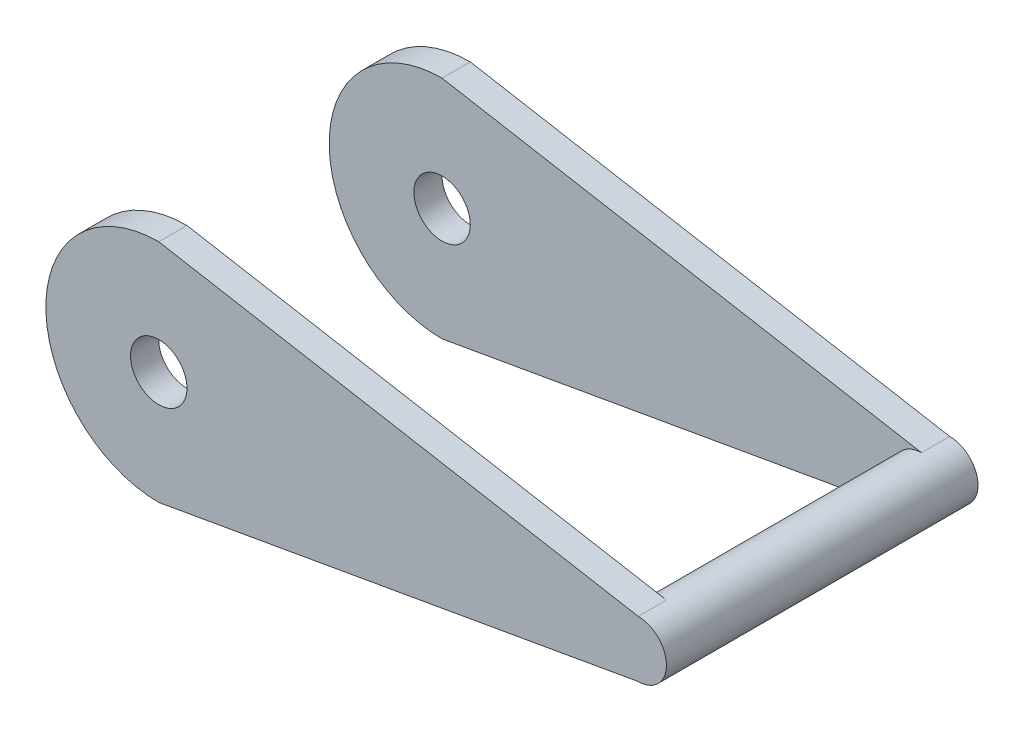
ISO-10303-21;
HEADER;
FILE_DESCRIPTION(('STEP AP214'),'2;1');
FILE_NAME('part.step','',(''),(''),'','','');
FILE_SCHEMA(('AUTOMOTIVE_DESIGN { 1 0 10303 214 1 1 1 1 }'));
ENDSEC;
DATA;
#1=APPLICATION_CONTEXT('core data for automotive mechanical design processes');
#2=APPLICATION_PROTOCOL_DEFINITION('international standard','automotive_design',2000,#1);
#3=PRODUCT_CONTEXT('',#1,'mechanical');
#4=PRODUCT('Part','Part','',(#3));
#5=PRODUCT_RELATED_PRODUCT_CATEGORY('part','',(#4));
#6=PRODUCT_DEFINITION_FORMATION('','',#4);
#7=PRODUCT_DEFINITION_CONTEXT('part definition',#1,'design');
#8=PRODUCT_DEFINITION('design','',#6,#7);
#9=PRODUCT_DEFINITION_SHAPE('','',#8);
#10=(LENGTH_UNIT() NAMED_UNIT(*) SI_UNIT(.MILLI.,.METRE.));
#11=(NAMED_UNIT(*) PLANE_ANGLE_UNIT() SI_UNIT($,.RADIAN.));
#12=(NAMED_UNIT(*) SI_UNIT($,.STERADIAN.) SOLID_ANGLE_UNIT());
#13=UNCERTAINTY_MEASURE_WITH_UNIT(LENGTH_MEASURE(1.E-05),#10,'distance_accuracy_value','');
#14=(GEOMETRIC_REPRESENTATION_CONTEXT(3) GLOBAL_UNCERTAINTY_ASSIGNED_CONTEXT((#13)) GLOBAL_UNIT_ASSIGNED_CONTEXT((#10,
#11,#12)) REPRESENTATION_CONTEXT('',''));
#15=CARTESIAN_POINT('',(0.,0.,0.));
#16=DIRECTION('',(0.,0.,1.));
#17=DIRECTION('',(1.,0.,0.));
#18=AXIS2_PLACEMENT_3D('',#15,#16,#17);
#19=CARTESIAN_POINT('',(20.3381760228693,115.189344312511,14.351));
#20=DIRECTION('',(-0.173873587443369,-0.984767980587089,0.));
#21=DIRECTION('',(0.984767980587089,-0.173873587443369,0.));
#22=AXIS2_PLACEMENT_3D('',#19,#20,#21);
#23=PLANE('',#22);
#24=DIRECTION('',(0.984767980587089,-0.173873587443369,0.));
#25=VECTOR('',#24,1.);
#26=CARTESIAN_POINT('',(20.3381760228693,115.189344312511,17.526));
#27=LINE('',#26,#25);
#28=CARTESIAN_POINT('',(238.125,76.7362496452517,17.526));
#29=VERTEX_POINT('',#28);
#30=CARTESIAN_POINT('',(292.071750354749,67.2112496452516,17.526));
#31=VERTEX_POINT('',#30);
#32=EDGE_CURVE('E175',#29,#31,#27,.T.);
#33=ORIENTED_EDGE('',*,*,#32,.T.);
#34=DIRECTION('',(0.,0.,1.));
#35=VECTOR('',#34,1.);
#36=CARTESIAN_POINT('',(292.071750354749,67.2112496452516,14.351));
#37=LINE('',#36,#35);
#38=CARTESIAN_POINT('',(292.071750354749,67.2112496452516,14.351));
#39=VERTEX_POINT('',#38);
#40=EDGE_CURVE('E48',#39,#31,#37,.T.);
#41=ORIENTED_EDGE('',*,*,#40,.F.);
#42=DIRECTION('',(0.984767980587089,-0.173873587443369,0.));
#43=VECTOR('',#42,1.);
#44=CARTESIAN_POINT('',(20.3381760228693,115.189344312511,14.351));
#45=LINE('',#44,#43);
#46=CARTESIAN_POINT('',(238.125,76.7362496452517,14.351));
#47=VERTEX_POINT('',#46);
#48=EDGE_CURVE('E166',#47,#39,#45,.T.);
#49=ORIENTED_EDGE('',*,*,#48,.F.);
#50=DIRECTION('',(0.,0.,1.));
#51=VECTOR('',#50,1.);
#52=CARTESIAN_POINT('',(238.125,76.7362496452517,14.351));
#53=LINE('',#52,#51);
#54=EDGE_CURVE('E42',#47,#29,#53,.T.);
#55=ORIENTED_EDGE('',*,*,#54,.T.);
#56=EDGE_LOOP('',(#33,#41,#49,#55));
#57=FACE_BOUND('',#56,.T.);
#58=ADVANCED_FACE('F38',(#57),#23,.F.);
#59=CARTESIAN_POINT('',(292.071750354749,64.0362496452517,14.351));
#60=DIRECTION('',(0.,0.,1.));
#61=DIRECTION('',(1.,0.,0.));
#62=AXIS2_PLACEMENT_3D('',#59,#60,#61);
#63=CYLINDRICAL_SURFACE('',#62,3.17499999999997);
#64=CARTESIAN_POINT('',(292.071750354749,64.0362496452517,17.526));
#65=DIRECTION('',(0.,0.,1.));
#66=DIRECTION('',(1.,0.,0.));
#67=AXIS2_PLACEMENT_3D('',#64,#65,#66);
#68=CIRCLE('',#67,3.17499999999997);
#69=CARTESIAN_POINT('',(292.071750354749,60.8612496452517,17.526));
#70=VERTEX_POINT('',#69);
#71=EDGE_CURVE('E167',#70,#31,#68,.T.);
#72=ORIENTED_EDGE('',*,*,#71,.F.);
#73=DIRECTION('',(0.,0.,1.));
#74=VECTOR('',#73,1.);
#75=CARTESIAN_POINT('',(292.071750354749,60.8612496452517,14.351));
#76=LINE('',#75,#74);
#77=CARTESIAN_POINT('',(292.071750354749,60.8612496452517,14.351));
#78=VERTEX_POINT('',#77);
#79=EDGE_CURVE('E73',#78,#70,#76,.T.);
#80=ORIENTED_EDGE('',*,*,#79,.F.);
#81=CARTESIAN_POINT('',(292.071750354749,64.0362496452517,14.351));
#82=DIRECTION('',(0.,0.,-1.));
#83=DIRECTION('',(-1.,0.,0.));
#84=AXIS2_PLACEMENT_3D('',#81,#82,#83);
#85=CIRCLE('',#84,3.17499999999997);
#86=EDGE_CURVE('E11',#78,#39,#85,.T.);
#87=ORIENTED_EDGE('',*,*,#86,.T.);
#88=ORIENTED_EDGE('',*,*,#40,.T.);
#89=EDGE_LOOP('',(#72,#80,#87,#88));
#90=FACE_BOUND('',#89,.T.);
#91=CARTESIAN_POINT('',(292.071750354749,64.0362496452517,-17.526));
#92=DIRECTION('',(0.,0.,1.));
#93=DIRECTION('',(1.,0.,0.));
#94=AXIS2_PLACEMENT_3D('',#91,#92,#93);
#95=CIRCLE('',#94,3.17499999999997);
#96=CARTESIAN_POINT('',(292.071750354749,60.8612496452517,-17.526));
#97=VERTEX_POINT('',#96);
#98=CARTESIAN_POINT('',(292.071750354749,67.2112496452516,-17.526));
#99=VERTEX_POINT('',#98);
#100=EDGE_CURVE('E131',#97,#99,#95,.T.);
#101=ORIENTED_EDGE('',*,*,#100,.T.);
#102=DIRECTION('',(0.,0.,-1.));
#103=VECTOR('',#102,1.);
#104=CARTESIAN_POINT('',(292.071750354749,67.2112496452516,-14.351));
#105=LINE('',#104,#103);
#106=CARTESIAN_POINT('',(292.071750354749,67.2112496452516,-14.351));
#107=VERTEX_POINT('',#106);
#108=EDGE_CURVE('E126',#107,#99,#105,.T.);
#109=ORIENTED_EDGE('',*,*,#108,.F.);
#110=CARTESIAN_POINT('',(292.071750354749,64.0362496452517,-14.351));
#111=DIRECTION('',(0.,0.,-1.));
#112=DIRECTION('',(-1.,0.,0.));
#113=AXIS2_PLACEMENT_3D('',#110,#111,#112);
#114=CIRCLE('',#113,3.17499999999997);
#115=CARTESIAN_POINT('',(292.071750354749,60.8612496452517,-14.351));
#116=VERTEX_POINT('',#115);
#117=EDGE_CURVE('E113',#116,#107,#114,.T.);
#118=ORIENTED_EDGE('',*,*,#117,.F.);
#119=DIRECTION('',(0.,0.,-1.));
#120=VECTOR('',#119,1.);
#121=CARTESIAN_POINT('',(292.071750354749,60.8612496452517,-14.351));
#122=LINE('',#121,#120);
#123=EDGE_CURVE('E135',#116,#97,#122,.T.);
#124=ORIENTED_EDGE('',*,*,#123,.T.);
#125=EDGE_LOOP('',(#101,#109,#118,#124));
#126=FACE_BOUND('',#125,.T.);
#127=ADVANCED_FACE('F129',(#90,#126),#63,.T.);
#128=CARTESIAN_POINT('',(-1.59105580116888,9.01126405313727,14.351));
#129=DIRECTION('',(0.173873587443369,-0.984767980587089,0.));
#130=DIRECTION('',(0.984767980587089,0.173873587443369,0.));
#131=AXIS2_PLACEMENT_3D('',#128,#129,#130);
#132=PLANE('',#131);
#133=DIRECTION('',(0.984767980587089,0.173873587443369,0.));
#134=VECTOR('',#133,1.);
#135=CARTESIAN_POINT('',(-1.59105580116888,9.01126405313727,17.526));
#136=LINE('',#135,#134);
#137=CARTESIAN_POINT('',(238.125,51.3362496452517,17.526));
#138=VERTEX_POINT('',#137);
#139=EDGE_CURVE('E180',#138,#70,#136,.T.);
#140=ORIENTED_EDGE('',*,*,#139,.F.);
#141=DIRECTION('',(0.,0.,1.));
#142=VECTOR('',#141,1.);
#143=CARTESIAN_POINT('',(238.125,51.3362496452517,14.351));
#144=LINE('',#143,#142);
#145=CARTESIAN_POINT('',(238.125,51.3362496452517,14.351));
#146=VERTEX_POINT('',#145);
#147=EDGE_CURVE('E185',#146,#138,#144,.T.);
#148=ORIENTED_EDGE('',*,*,#147,.F.);
#149=DIRECTION('',(0.984767980587089,0.173873587443369,0.));
#150=VECTOR('',#149,1.);
#151=CARTESIAN_POINT('',(-1.59105580116888,9.01126405313727,14.351));
#152=LINE('',#151,#150);
#153=EDGE_CURVE('E171',#146,#78,#152,.T.);
#154=ORIENTED_EDGE('',*,*,#153,.T.);
#155=ORIENTED_EDGE('',*,*,#79,.T.);
#156=EDGE_LOOP('',(#140,#148,#154,#155));
#157=FACE_BOUND('',#156,.T.);
#158=ADVANCED_FACE('F200',(#157),#132,.T.);
#159=CARTESIAN_POINT('',(238.125,64.0362496452517,14.351));
#160=DIRECTION('',(0.,0.,1.));
#161=DIRECTION('',(1.,0.,0.));
#162=AXIS2_PLACEMENT_3D('',#159,#160,#161);
#163=CYLINDRICAL_SURFACE('',#162,3.175);
#164=CARTESIAN_POINT('',(238.125,64.0362496452517,14.351));
#165=DIRECTION('',(0.,0.,1.));
#166=DIRECTION('',(1.,0.,0.));
#167=AXIS2_PLACEMENT_3D('',#164,#165,#166);
#168=CIRCLE('',#167,3.175);
#169=CARTESIAN_POINT('',(241.3,64.0362496452517,14.351));
#170=VERTEX_POINT('',#169);
#171=EDGE_CURVE('E163',#170,#170,#168,.T.);
#172=ORIENTED_EDGE('',*,*,#171,.F.);
#173=EDGE_LOOP('',(#172));
#174=FACE_BOUND('',#173,.T.);
#175=CARTESIAN_POINT('',(238.125,64.0362496452517,17.526));
#176=DIRECTION('',(0.,0.,1.));
#177=DIRECTION('',(1.,0.,0.));
#178=AXIS2_PLACEMENT_3D('',#175,#176,#177);
#179=CIRCLE('',#178,3.175);
#180=CARTESIAN_POINT('',(241.3,64.0362496452517,17.526));
#181=VERTEX_POINT('',#180);
#182=EDGE_CURVE('E125',#181,#181,#179,.T.);
#183=ORIENTED_EDGE('',*,*,#182,.T.);
#184=EDGE_LOOP('',(#183));
#185=FACE_BOUND('',#184,.T.);
#186=ADVANCED_FACE('F40',(#174,#185),#163,.F.);
#187=CARTESIAN_POINT('',(238.125,64.0362496452517,14.351));
#188=DIRECTION('',(0.,0.,1.));
#189=DIRECTION('',(1.,0.,0.));
#190=AXIS2_PLACEMENT_3D('',#187,#188,#189);
#191=CYLINDRICAL_SURFACE('',#190,12.7);
#192=CARTESIAN_POINT('',(238.125,64.0362496452517,17.526));
#193=DIRECTION('',(0.,0.,1.));
#194=DIRECTION('',(1.,0.,0.));
#195=AXIS2_PLACEMENT_3D('',#192,#193,#194);
#196=CIRCLE('',#195,12.7);
#197=EDGE_CURVE('E177',#29,#138,#196,.T.);
#198=ORIENTED_EDGE('',*,*,#197,.F.);
#199=ORIENTED_EDGE('',*,*,#54,.F.);
#200=CARTESIAN_POINT('',(238.125,64.0362496452517,14.351));
#201=DIRECTION('',(0.,0.,1.));
#202=DIRECTION('',(1.,0.,0.));
#203=AXIS2_PLACEMENT_3D('',#200,#201,#202);
#204=CIRCLE('',#203,12.7);
#205=EDGE_CURVE('E169',#47,#146,#204,.T.);
#206=ORIENTED_EDGE('',*,*,#205,.T.);
#207=ORIENTED_EDGE('',*,*,#147,.T.);
#208=EDGE_LOOP('',(#198,#199,#206,#207));
#209=FACE_BOUND('',#208,.T.);
#210=ADVANCED_FACE('F191',(#209),#191,.T.);
#211=CARTESIAN_POINT('',(0.,0.,14.351));
#212=DIRECTION('',(0.,0.,1.));
#213=DIRECTION('',(1.,0.,0.));
#214=AXIS2_PLACEMENT_3D('',#211,#212,#213);
#215=PLANE('',#214);
#216=ORIENTED_EDGE('',*,*,#86,.F.);
#217=ORIENTED_EDGE('',*,*,#153,.F.);
#218=ORIENTED_EDGE('',*,*,#205,.F.);
#219=ORIENTED_EDGE('',*,*,#48,.T.);
#220=EDGE_LOOP('',(#216,#217,#218,#219));
#221=FACE_BOUND('',#220,.T.);
#222=ORIENTED_EDGE('',*,*,#171,.T.);
#223=EDGE_LOOP('',(#222));
#224=FACE_BOUND('',#223,.T.);
#225=ADVANCED_FACE('F193',(#221,#224),#215,.F.);
#226=CARTESIAN_POINT('',(0.,0.,17.526));
#227=DIRECTION('',(0.,0.,1.));
#228=DIRECTION('',(1.,0.,0.));
#229=AXIS2_PLACEMENT_3D('',#226,#227,#228);
#230=PLANE('',#229);
#231=ORIENTED_EDGE('',*,*,#182,.F.);
#232=EDGE_LOOP('',(#231));
#233=FACE_BOUND('',#232,.T.);
#234=ORIENTED_EDGE('',*,*,#32,.F.);
#235=ORIENTED_EDGE('',*,*,#197,.T.);
#236=ORIENTED_EDGE('',*,*,#139,.T.);
#237=ORIENTED_EDGE('',*,*,#71,.T.);
#238=EDGE_LOOP('',(#234,#235,#236,#237));
#239=FACE_BOUND('',#238,.T.);
#240=ADVANCED_FACE('F190',(#233,#239),#230,.T.);
#241=CARTESIAN_POINT('',(20.3381760228693,115.189344312511,-14.351));
#242=DIRECTION('',(-0.173873587443369,-0.984767980587089,0.));
#243=DIRECTION('',(0.984767980587089,-0.173873587443369,0.));
#244=AXIS2_PLACEMENT_3D('',#241,#242,#243);
#245=PLANE('',#244);
#246=DIRECTION('',(0.984767980587089,-0.173873587443369,0.));
#247=VECTOR('',#246,1.);
#248=CARTESIAN_POINT('',(20.3381760228693,115.189344312511,-17.526));
#249=LINE('',#248,#247);
#250=CARTESIAN_POINT('',(238.125,76.7362496452517,-17.526));
#251=VERTEX_POINT('',#250);
#252=EDGE_CURVE('E151',#251,#99,#249,.T.);
#253=ORIENTED_EDGE('',*,*,#252,.F.);
#254=DIRECTION('',(0.,0.,-1.));
#255=VECTOR('',#254,1.);
#256=CARTESIAN_POINT('',(238.125,76.7362496452517,-14.351));
#257=LINE('',#256,#255);
#258=CARTESIAN_POINT('',(238.125,76.7362496452517,-14.351));
#259=VERTEX_POINT('',#258);
#260=EDGE_CURVE('E139',#259,#251,#257,.T.);
#261=ORIENTED_EDGE('',*,*,#260,.F.);
#262=DIRECTION('',(0.984767980587089,-0.173873587443369,0.));
#263=VECTOR('',#262,1.);
#264=CARTESIAN_POINT('',(20.3381760228693,115.189344312511,-14.351));
#265=LINE('',#264,#263);
#266=EDGE_CURVE('E118',#259,#107,#265,.T.);
#267=ORIENTED_EDGE('',*,*,#266,.T.);
#268=ORIENTED_EDGE('',*,*,#108,.T.);
#269=EDGE_LOOP('',(#253,#261,#267,#268));
#270=FACE_BOUND('',#269,.T.);
#271=ADVANCED_FACE('F137',(#270),#245,.F.);
#272=CARTESIAN_POINT('',(-1.59105580116888,9.01126405313727,-14.351));
#273=DIRECTION('',(0.173873587443369,-0.984767980587089,0.));
#274=DIRECTION('',(0.984767980587089,0.173873587443369,0.));
#275=AXIS2_PLACEMENT_3D('',#272,#273,#274);
#276=PLANE('',#275);
#277=DIRECTION('',(0.984767980587089,0.173873587443369,0.));
#278=VECTOR('',#277,1.);
#279=CARTESIAN_POINT('',(-1.59105580116888,9.01126405313727,-17.526));
#280=LINE('',#279,#278);
#281=CARTESIAN_POINT('',(238.125,51.3362496452517,-17.526));
#282=VERTEX_POINT('',#281);
#283=EDGE_CURVE('E155',#282,#97,#280,.T.);
#284=ORIENTED_EDGE('',*,*,#283,.T.);
#285=ORIENTED_EDGE('',*,*,#123,.F.);
#286=DIRECTION('',(0.984767980587089,0.173873587443369,0.));
#287=VECTOR('',#286,1.);
#288=CARTESIAN_POINT('',(-1.59105580116888,9.01126405313727,-14.351));
#289=LINE('',#288,#287);
#290=CARTESIAN_POINT('',(238.125,51.3362496452517,-14.351));
#291=VERTEX_POINT('',#290);
#292=EDGE_CURVE('E121',#291,#116,#289,.T.);
#293=ORIENTED_EDGE('',*,*,#292,.F.);
#294=DIRECTION('',(0.,0.,-1.));
#295=VECTOR('',#294,1.);
#296=CARTESIAN_POINT('',(238.125,51.3362496452517,-14.351));
#297=LINE('',#296,#295);
#298=EDGE_CURVE('E159',#291,#282,#297,.T.);
#299=ORIENTED_EDGE('',*,*,#298,.T.);
#300=EDGE_LOOP('',(#284,#285,#293,#299));
#301=FACE_BOUND('',#300,.T.);
#302=ADVANCED_FACE('F219',(#301),#276,.T.);
#303=CARTESIAN_POINT('',(238.125,64.0362496452517,-14.351));
#304=DIRECTION('',(0.,0.,-1.));
#305=DIRECTION('',(1.,0.,0.));
#306=AXIS2_PLACEMENT_3D('',#303,#304,#305);
#307=CYLINDRICAL_SURFACE('',#306,3.175);
#308=CARTESIAN_POINT('',(238.125,64.0362496452517,-14.351));
#309=DIRECTION('',(0.,0.,1.));
#310=DIRECTION('',(1.,0.,0.));
#311=AXIS2_PLACEMENT_3D('',#308,#309,#310);
#312=CIRCLE('',#311,3.175);
#313=CARTESIAN_POINT('',(241.3,64.0362496452517,-14.351));
#314=VERTEX_POINT('',#313);
#315=EDGE_CURVE('E141',#314,#314,#312,.T.);
#316=ORIENTED_EDGE('',*,*,#315,.T.);
#317=EDGE_LOOP('',(#316));
#318=FACE_BOUND('',#317,.T.);
#319=CARTESIAN_POINT('',(238.125,64.0362496452517,-17.526));
#320=DIRECTION('',(0.,0.,1.));
#321=DIRECTION('',(1.,0.,0.));
#322=AXIS2_PLACEMENT_3D('',#319,#320,#321);
#323=CIRCLE('',#322,3.175);
#324=CARTESIAN_POINT('',(241.3,64.0362496452517,-17.526));
#325=VERTEX_POINT('',#324);
#326=EDGE_CURVE('E148',#325,#325,#323,.T.);
#327=ORIENTED_EDGE('',*,*,#326,.F.);
#328=EDGE_LOOP('',(#327));
#329=FACE_BOUND('',#328,.T.);
#330=ADVANCED_FACE('F215',(#318,#329),#307,.F.);
#331=CARTESIAN_POINT('',(238.125,64.0362496452517,-14.351));
#332=DIRECTION('',(0.,0.,-1.));
#333=DIRECTION('',(1.,0.,0.));
#334=AXIS2_PLACEMENT_3D('',#331,#332,#333);
#335=CYLINDRICAL_SURFACE('',#334,12.7);
#336=CARTESIAN_POINT('',(238.125,64.0362496452517,-17.526));
#337=DIRECTION('',(0.,0.,1.));
#338=DIRECTION('',(1.,0.,0.));
#339=AXIS2_PLACEMENT_3D('',#336,#337,#338);
#340=CIRCLE('',#339,12.7);
#341=EDGE_CURVE('E153',#251,#282,#340,.T.);
#342=ORIENTED_EDGE('',*,*,#341,.T.);
#343=ORIENTED_EDGE('',*,*,#298,.F.);
#344=CARTESIAN_POINT('',(238.125,64.0362496452517,-14.351));
#345=DIRECTION('',(0.,0.,1.));
#346=DIRECTION('',(1.,0.,0.));
#347=AXIS2_PLACEMENT_3D('',#344,#345,#346);
#348=CIRCLE('',#347,12.7);
#349=EDGE_CURVE('E140',#259,#291,#348,.T.);
#350=ORIENTED_EDGE('',*,*,#349,.F.);
#351=ORIENTED_EDGE('',*,*,#260,.T.);
#352=EDGE_LOOP('',(#342,#343,#350,#351));
#353=FACE_BOUND('',#352,.T.);
#354=ADVANCED_FACE('F218',(#353),#335,.T.);
#355=CARTESIAN_POINT('',(0.,0.,-14.351));
#356=DIRECTION('',(0.,0.,-1.));
#357=DIRECTION('',(1.,0.,0.));
#358=AXIS2_PLACEMENT_3D('',#355,#356,#357);
#359=PLANE('',#358);
#360=ORIENTED_EDGE('',*,*,#117,.T.);
#361=ORIENTED_EDGE('',*,*,#266,.F.);
#362=ORIENTED_EDGE('',*,*,#349,.T.);
#363=ORIENTED_EDGE('',*,*,#292,.T.);
#364=EDGE_LOOP('',(#360,#361,#362,#363));
#365=FACE_BOUND('',#364,.T.);
#366=ORIENTED_EDGE('',*,*,#315,.F.);
#367=EDGE_LOOP('',(#366));
#368=FACE_BOUND('',#367,.T.);
#369=ADVANCED_FACE('F115',(#365,#368),#359,.F.);
#370=CARTESIAN_POINT('',(0.,0.,-17.526));
#371=DIRECTION('',(0.,0.,-1.));
#372=DIRECTION('',(1.,0.,0.));
#373=AXIS2_PLACEMENT_3D('',#370,#371,#372);
#374=PLANE('',#373);
#375=ORIENTED_EDGE('',*,*,#326,.T.);
#376=EDGE_LOOP('',(#375));
#377=FACE_BOUND('',#376,.T.);
#378=ORIENTED_EDGE('',*,*,#252,.T.);
#379=ORIENTED_EDGE('',*,*,#100,.F.);
#380=ORIENTED_EDGE('',*,*,#283,.F.);
#381=ORIENTED_EDGE('',*,*,#341,.F.);
#382=EDGE_LOOP('',(#378,#379,#380,#381));
#383=FACE_BOUND('',#382,.T.);
#384=ADVANCED_FACE('F229',(#377,#383),#374,.T.);
#385=CLOSED_SHELL('',(#58,#127,#158,#186,#210,#225,#240,#271,#302,#330,#354,#369,#384));
#386=MANIFOLD_SOLID_BREP('B2',#385);
#387=ADVANCED_BREP_SHAPE_REPRESENTATION('',(#18,#386),#14);
#388=SHAPE_DEFINITION_REPRESENTATION(#9,#387);
ENDSEC;
END-ISO-10303-21;
